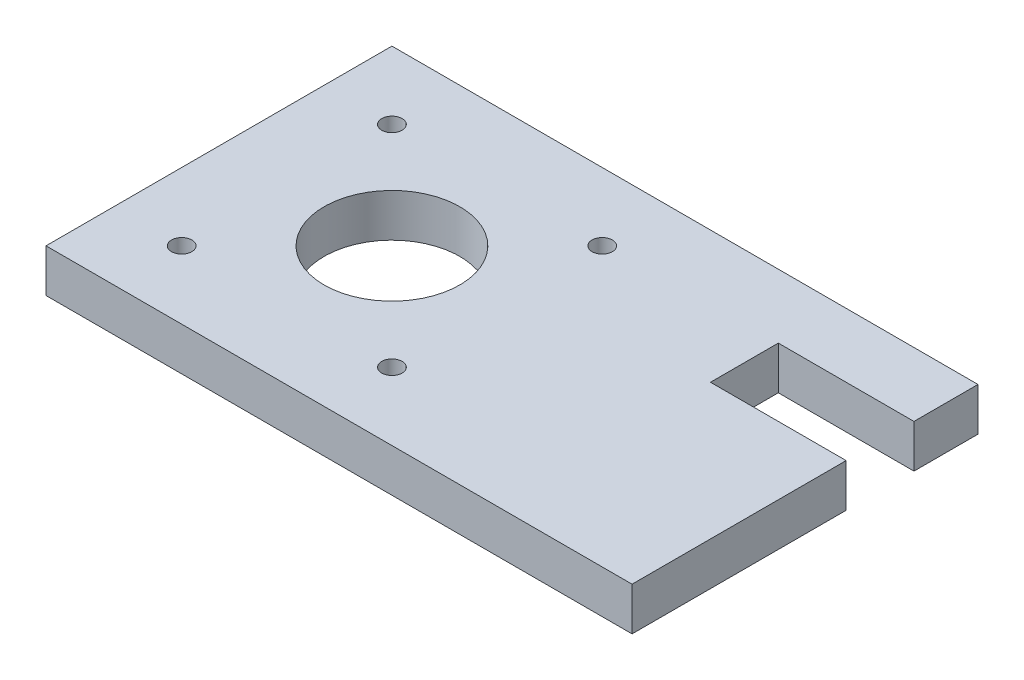
ISO-10303-21;
HEADER;
FILE_DESCRIPTION(('STEP AP214'),'2;1');
FILE_NAME('part.step','',(''),(''),'','','');
FILE_SCHEMA(('AUTOMOTIVE_DESIGN { 1 0 10303 214 1 1 1 1 }'));
ENDSEC;
DATA;
#1=APPLICATION_CONTEXT('core data for automotive mechanical design processes');
#2=APPLICATION_PROTOCOL_DEFINITION('international standard','automotive_design',2000,#1);
#3=PRODUCT_CONTEXT('',#1,'mechanical');
#4=PRODUCT('Part','Part','',(#3));
#5=PRODUCT_RELATED_PRODUCT_CATEGORY('part','',(#4));
#6=PRODUCT_DEFINITION_FORMATION('','',#4);
#7=PRODUCT_DEFINITION_CONTEXT('part definition',#1,'design');
#8=PRODUCT_DEFINITION('design','',#6,#7);
#9=PRODUCT_DEFINITION_SHAPE('','',#8);
#10=(LENGTH_UNIT() NAMED_UNIT(*) SI_UNIT(.MILLI.,.METRE.));
#11=(NAMED_UNIT(*) PLANE_ANGLE_UNIT() SI_UNIT($,.RADIAN.));
#12=(NAMED_UNIT(*) SI_UNIT($,.STERADIAN.) SOLID_ANGLE_UNIT());
#13=UNCERTAINTY_MEASURE_WITH_UNIT(LENGTH_MEASURE(1.E-05),#10,'distance_accuracy_value','');
#14=(GEOMETRIC_REPRESENTATION_CONTEXT(3) GLOBAL_UNCERTAINTY_ASSIGNED_CONTEXT((#13)) GLOBAL_UNIT_ASSIGNED_CONTEXT((#10,
#11,#12)) REPRESENTATION_CONTEXT('',''));
#15=CARTESIAN_POINT('',(0.,0.,0.));
#16=DIRECTION('',(0.,0.,1.));
#17=DIRECTION('',(1.,0.,0.));
#18=AXIS2_PLACEMENT_3D('',#15,#16,#17);
#19=CARTESIAN_POINT('',(0.,6.35,0.));
#20=DIRECTION('',(0.,-1.,0.));
#21=DIRECTION('',(0.,0.,-1.));
#22=AXIS2_PLACEMENT_3D('',#19,#20,#21);
#23=PLANE('',#22);
#24=DIRECTION('',(1.,0.,0.));
#25=VECTOR('',#24,1.);
#26=CARTESIAN_POINT('',(-25.5,6.35,25.5));
#27=LINE('',#26,#25);
#28=CARTESIAN_POINT('',(-25.5,6.35,25.5));
#29=VERTEX_POINT('',#28);
#30=CARTESIAN_POINT('',(60.9,6.35,25.5));
#31=VERTEX_POINT('',#30);
#32=EDGE_CURVE('E94',#29,#31,#27,.T.);
#33=ORIENTED_EDGE('',*,*,#32,.T.);
#34=DIRECTION('',(0.,0.,-1.));
#35=VECTOR('',#34,1.);
#36=CARTESIAN_POINT('',(60.9,6.35,-6.06183824368279));
#37=LINE('',#36,#35);
#38=CARTESIAN_POINT('',(60.9,6.35,-6.06183824368279));
#39=VERTEX_POINT('',#38);
#40=EDGE_CURVE('E179',#31,#39,#37,.T.);
#41=ORIENTED_EDGE('',*,*,#40,.T.);
#42=DIRECTION('',(-1.,0.,0.));
#43=VECTOR('',#42,1.);
#44=CARTESIAN_POINT('',(60.9,6.35,-6.06183824368279));
#45=LINE('',#44,#43);
#46=CARTESIAN_POINT('',(40.9,6.35,-6.06183824368279));
#47=VERTEX_POINT('',#46);
#48=EDGE_CURVE('E162',#39,#47,#45,.T.);
#49=ORIENTED_EDGE('',*,*,#48,.T.);
#50=DIRECTION('',(0.,0.,-1.));
#51=VECTOR('',#50,1.);
#52=CARTESIAN_POINT('',(40.9,6.35,-6.06183824368279));
#53=LINE('',#52,#51);
#54=CARTESIAN_POINT('',(40.9,6.35,-16.0618382436828));
#55=VERTEX_POINT('',#54);
#56=EDGE_CURVE('E175',#47,#55,#53,.T.);
#57=ORIENTED_EDGE('',*,*,#56,.T.);
#58=DIRECTION('',(1.,0.,0.));
#59=VECTOR('',#58,1.);
#60=CARTESIAN_POINT('',(60.9,6.35,-16.0618382436828));
#61=LINE('',#60,#59);
#62=CARTESIAN_POINT('',(60.9,6.35,-16.0618382436828));
#63=VERTEX_POINT('',#62);
#64=EDGE_CURVE('E114',#55,#63,#61,.T.);
#65=ORIENTED_EDGE('',*,*,#64,.T.);
#66=DIRECTION('',(0.,0.,-1.));
#67=VECTOR('',#66,1.);
#68=CARTESIAN_POINT('',(60.9,6.35,-25.5));
#69=LINE('',#68,#67);
#70=CARTESIAN_POINT('',(60.9,6.35,-25.5));
#71=VERTEX_POINT('',#70);
#72=EDGE_CURVE('E108',#63,#71,#69,.T.);
#73=ORIENTED_EDGE('',*,*,#72,.T.);
#74=DIRECTION('',(-1.,0.,0.));
#75=VECTOR('',#74,1.);
#76=CARTESIAN_POINT('',(60.9,6.35,-25.5));
#77=LINE('',#76,#75);
#78=CARTESIAN_POINT('',(-25.5,6.35,-25.5));
#79=VERTEX_POINT('',#78);
#80=EDGE_CURVE('E112',#71,#79,#77,.T.);
#81=ORIENTED_EDGE('',*,*,#80,.T.);
#82=DIRECTION('',(0.,0.,1.));
#83=VECTOR('',#82,1.);
#84=CARTESIAN_POINT('',(-25.5,6.35,-25.5));
#85=LINE('',#84,#83);
#86=EDGE_CURVE('E52',#79,#29,#85,.T.);
#87=ORIENTED_EDGE('',*,*,#86,.T.);
#88=EDGE_LOOP('',(#33,#41,#49,#57,#65,#73,#81,#87));
#89=FACE_BOUND('',#88,.T.);
#90=CARTESIAN_POINT('',(15.5,6.35,-15.5));
#91=DIRECTION('',(0.,1.,0.));
#92=DIRECTION('',(0.,0.,1.));
#93=AXIS2_PLACEMENT_3D('',#90,#91,#92);
#94=CIRCLE('',#93,1.5);
#95=CARTESIAN_POINT('',(15.5,6.35,-14.));
#96=VERTEX_POINT('',#95);
#97=EDGE_CURVE('E134',#96,#96,#94,.T.);
#98=ORIENTED_EDGE('',*,*,#97,.F.);
#99=EDGE_LOOP('',(#98));
#100=FACE_BOUND('',#99,.T.);
#101=CARTESIAN_POINT('',(15.5,6.35,15.5));
#102=DIRECTION('',(0.,1.,0.));
#103=DIRECTION('',(0.,0.,1.));
#104=AXIS2_PLACEMENT_3D('',#101,#102,#103);
#105=CIRCLE('',#104,1.5);
#106=CARTESIAN_POINT('',(15.5,6.35,17.));
#107=VERTEX_POINT('',#106);
#108=EDGE_CURVE('E185',#107,#107,#105,.T.);
#109=ORIENTED_EDGE('',*,*,#108,.F.);
#110=EDGE_LOOP('',(#109));
#111=FACE_BOUND('',#110,.T.);
#112=CARTESIAN_POINT('',(-15.5,6.35,15.5));
#113=DIRECTION('',(0.,1.,0.));
#114=DIRECTION('',(0.,0.,1.));
#115=AXIS2_PLACEMENT_3D('',#112,#113,#114);
#116=CIRCLE('',#115,1.5);
#117=CARTESIAN_POINT('',(-15.5,6.35,17.));
#118=VERTEX_POINT('',#117);
#119=EDGE_CURVE('E191',#118,#118,#116,.T.);
#120=ORIENTED_EDGE('',*,*,#119,.F.);
#121=EDGE_LOOP('',(#120));
#122=FACE_BOUND('',#121,.T.);
#123=CARTESIAN_POINT('',(-15.5,6.35,-15.5));
#124=DIRECTION('',(0.,1.,0.));
#125=DIRECTION('',(0.,0.,1.));
#126=AXIS2_PLACEMENT_3D('',#123,#124,#125);
#127=CIRCLE('',#126,1.5);
#128=CARTESIAN_POINT('',(-15.5,6.35,-14.));
#129=VERTEX_POINT('',#128);
#130=EDGE_CURVE('E197',#129,#129,#127,.T.);
#131=ORIENTED_EDGE('',*,*,#130,.F.);
#132=EDGE_LOOP('',(#131));
#133=FACE_BOUND('',#132,.T.);
#134=CARTESIAN_POINT('',(0.,6.35,0.));
#135=DIRECTION('',(0.,1.,0.));
#136=DIRECTION('',(0.,0.,1.));
#137=AXIS2_PLACEMENT_3D('',#134,#135,#136);
#138=CIRCLE('',#137,10.);
#139=CARTESIAN_POINT('',(0.,6.35,10.));
#140=VERTEX_POINT('',#139);
#141=EDGE_CURVE('E203',#140,#140,#138,.T.);
#142=ORIENTED_EDGE('',*,*,#141,.F.);
#143=EDGE_LOOP('',(#142));
#144=FACE_BOUND('',#143,.T.);
#145=ADVANCED_FACE('F35',(#89,#100,#111,#122,#133,#144),#23,.F.);
#146=CARTESIAN_POINT('',(0.,0.,0.));
#147=DIRECTION('',(0.,-1.,0.));
#148=DIRECTION('',(0.,0.,-1.));
#149=AXIS2_PLACEMENT_3D('',#146,#147,#148);
#150=PLANE('',#149);
#151=CARTESIAN_POINT('',(-15.5,0.,-15.5));
#152=DIRECTION('',(0.,1.,0.));
#153=DIRECTION('',(0.,0.,1.));
#154=AXIS2_PLACEMENT_3D('',#151,#152,#153);
#155=CIRCLE('',#154,1.5);
#156=CARTESIAN_POINT('',(-15.5,0.,-14.));
#157=VERTEX_POINT('',#156);
#158=EDGE_CURVE('E200',#157,#157,#155,.T.);
#159=ORIENTED_EDGE('',*,*,#158,.T.);
#160=EDGE_LOOP('',(#159));
#161=FACE_BOUND('',#160,.T.);
#162=CARTESIAN_POINT('',(15.5,0.,15.5));
#163=DIRECTION('',(0.,1.,0.));
#164=DIRECTION('',(0.,0.,1.));
#165=AXIS2_PLACEMENT_3D('',#162,#163,#164);
#166=CIRCLE('',#165,1.5);
#167=CARTESIAN_POINT('',(15.5,0.,17.));
#168=VERTEX_POINT('',#167);
#169=EDGE_CURVE('E188',#168,#168,#166,.T.);
#170=ORIENTED_EDGE('',*,*,#169,.T.);
#171=EDGE_LOOP('',(#170));
#172=FACE_BOUND('',#171,.T.);
#173=DIRECTION('',(1.,0.,0.));
#174=VECTOR('',#173,1.);
#175=CARTESIAN_POINT('',(60.9,0.,25.5));
#176=LINE('',#175,#174);
#177=CARTESIAN_POINT('',(-25.5,0.,25.5));
#178=VERTEX_POINT('',#177);
#179=CARTESIAN_POINT('',(60.9,0.,25.5));
#180=VERTEX_POINT('',#179);
#181=EDGE_CURVE('E88',#178,#180,#176,.T.);
#182=ORIENTED_EDGE('',*,*,#181,.F.);
#183=DIRECTION('',(0.,0.,1.));
#184=VECTOR('',#183,1.);
#185=CARTESIAN_POINT('',(-25.5,0.,-25.5));
#186=LINE('',#185,#184);
#187=CARTESIAN_POINT('',(-25.5,0.,-25.5));
#188=VERTEX_POINT('',#187);
#189=EDGE_CURVE('E144',#188,#178,#186,.T.);
#190=ORIENTED_EDGE('',*,*,#189,.F.);
#191=DIRECTION('',(-1.,0.,0.));
#192=VECTOR('',#191,1.);
#193=CARTESIAN_POINT('',(60.9,0.,-25.5));
#194=LINE('',#193,#192);
#195=CARTESIAN_POINT('',(60.9,0.,-25.5));
#196=VERTEX_POINT('',#195);
#197=EDGE_CURVE('E81',#196,#188,#194,.T.);
#198=ORIENTED_EDGE('',*,*,#197,.F.);
#199=DIRECTION('',(0.,0.,-1.));
#200=VECTOR('',#199,1.);
#201=CARTESIAN_POINT('',(60.9,0.,-25.5));
#202=LINE('',#201,#200);
#203=CARTESIAN_POINT('',(60.9,0.,-16.0618382436828));
#204=VERTEX_POINT('',#203);
#205=EDGE_CURVE('E122',#204,#196,#202,.T.);
#206=ORIENTED_EDGE('',*,*,#205,.F.);
#207=DIRECTION('',(1.,0.,0.));
#208=VECTOR('',#207,1.);
#209=CARTESIAN_POINT('',(60.9,0.,-16.0618382436828));
#210=LINE('',#209,#208);
#211=CARTESIAN_POINT('',(40.9,0.,-16.0618382436828));
#212=VERTEX_POINT('',#211);
#213=EDGE_CURVE('E140',#212,#204,#210,.T.);
#214=ORIENTED_EDGE('',*,*,#213,.F.);
#215=DIRECTION('',(0.,0.,-1.));
#216=VECTOR('',#215,1.);
#217=CARTESIAN_POINT('',(40.9,0.,-6.06183824368279));
#218=LINE('',#217,#216);
#219=CARTESIAN_POINT('',(40.9,0.,-6.06183824368279));
#220=VERTEX_POINT('',#219);
#221=EDGE_CURVE('E138',#220,#212,#218,.T.);
#222=ORIENTED_EDGE('',*,*,#221,.F.);
#223=DIRECTION('',(-1.,0.,0.));
#224=VECTOR('',#223,1.);
#225=CARTESIAN_POINT('',(60.9,0.,-6.06183824368279));
#226=LINE('',#225,#224);
#227=CARTESIAN_POINT('',(60.9,0.,-6.06183824368279));
#228=VERTEX_POINT('',#227);
#229=EDGE_CURVE('E136',#228,#220,#226,.T.);
#230=ORIENTED_EDGE('',*,*,#229,.F.);
#231=DIRECTION('',(0.,0.,-1.));
#232=VECTOR('',#231,1.);
#233=CARTESIAN_POINT('',(60.9,0.,-6.06183824368279));
#234=LINE('',#233,#232);
#235=EDGE_CURVE('E133',#180,#228,#234,.T.);
#236=ORIENTED_EDGE('',*,*,#235,.F.);
#237=EDGE_LOOP('',(#182,#190,#198,#206,#214,#222,#230,#236));
#238=FACE_BOUND('',#237,.T.);
#239=CARTESIAN_POINT('',(15.5,0.,-15.5));
#240=DIRECTION('',(0.,1.,0.));
#241=DIRECTION('',(0.,0.,1.));
#242=AXIS2_PLACEMENT_3D('',#239,#240,#241);
#243=CIRCLE('',#242,1.5);
#244=CARTESIAN_POINT('',(15.5,0.,-14.));
#245=VERTEX_POINT('',#244);
#246=EDGE_CURVE('E182',#245,#245,#243,.T.);
#247=ORIENTED_EDGE('',*,*,#246,.T.);
#248=EDGE_LOOP('',(#247));
#249=FACE_BOUND('',#248,.T.);
#250=CARTESIAN_POINT('',(-15.5,0.,15.5));
#251=DIRECTION('',(0.,1.,0.));
#252=DIRECTION('',(0.,0.,1.));
#253=AXIS2_PLACEMENT_3D('',#250,#251,#252);
#254=CIRCLE('',#253,1.5);
#255=CARTESIAN_POINT('',(-15.5,0.,17.));
#256=VERTEX_POINT('',#255);
#257=EDGE_CURVE('E194',#256,#256,#254,.T.);
#258=ORIENTED_EDGE('',*,*,#257,.T.);
#259=EDGE_LOOP('',(#258));
#260=FACE_BOUND('',#259,.T.);
#261=CARTESIAN_POINT('',(0.,0.,0.));
#262=DIRECTION('',(0.,1.,0.));
#263=DIRECTION('',(0.,0.,1.));
#264=AXIS2_PLACEMENT_3D('',#261,#262,#263);
#265=CIRCLE('',#264,10.);
#266=CARTESIAN_POINT('',(0.,0.,10.));
#267=VERTEX_POINT('',#266);
#268=EDGE_CURVE('E206',#267,#267,#265,.T.);
#269=ORIENTED_EDGE('',*,*,#268,.T.);
#270=EDGE_LOOP('',(#269));
#271=FACE_BOUND('',#270,.T.);
#272=ADVANCED_FACE('F166',(#161,#172,#238,#249,#260,#271),#150,.T.);
#273=CARTESIAN_POINT('',(60.9,6.35,25.5));
#274=DIRECTION('',(0.,0.,-1.));
#275=DIRECTION('',(-1.,0.,0.));
#276=AXIS2_PLACEMENT_3D('',#273,#274,#275);
#277=PLANE('',#276);
#278=ORIENTED_EDGE('',*,*,#181,.T.);
#279=DIRECTION('',(0.,-1.,0.));
#280=VECTOR('',#279,1.);
#281=CARTESIAN_POINT('',(60.9,6.35,25.5));
#282=LINE('',#281,#280);
#283=EDGE_CURVE('E11',#31,#180,#282,.T.);
#284=ORIENTED_EDGE('',*,*,#283,.F.);
#285=ORIENTED_EDGE('',*,*,#32,.F.);
#286=DIRECTION('',(0.,-1.,0.));
#287=VECTOR('',#286,1.);
#288=CARTESIAN_POINT('',(-25.5,6.35,25.5));
#289=LINE('',#288,#287);
#290=EDGE_CURVE('E128',#29,#178,#289,.T.);
#291=ORIENTED_EDGE('',*,*,#290,.T.);
#292=EDGE_LOOP('',(#278,#284,#285,#291));
#293=FACE_BOUND('',#292,.T.);
#294=ADVANCED_FACE('F37',(#293),#277,.F.);
#295=CARTESIAN_POINT('',(60.9,6.35,-6.06183824368279));
#296=DIRECTION('',(-1.,0.,0.));
#297=DIRECTION('',(0.,0.,1.));
#298=AXIS2_PLACEMENT_3D('',#295,#296,#297);
#299=PLANE('',#298);
#300=ORIENTED_EDGE('',*,*,#235,.T.);
#301=DIRECTION('',(0.,-1.,0.));
#302=VECTOR('',#301,1.);
#303=CARTESIAN_POINT('',(60.9,6.35,-6.06183824368279));
#304=LINE('',#303,#302);
#305=EDGE_CURVE('E44',#39,#228,#304,.T.);
#306=ORIENTED_EDGE('',*,*,#305,.F.);
#307=ORIENTED_EDGE('',*,*,#40,.F.);
#308=ORIENTED_EDGE('',*,*,#283,.T.);
#309=EDGE_LOOP('',(#300,#306,#307,#308));
#310=FACE_BOUND('',#309,.T.);
#311=ADVANCED_FACE('F239',(#310),#299,.F.);
#312=CARTESIAN_POINT('',(60.9,6.35,-6.06183824368279));
#313=DIRECTION('',(0.,0.,1.));
#314=DIRECTION('',(1.,0.,0.));
#315=AXIS2_PLACEMENT_3D('',#312,#313,#314);
#316=PLANE('',#315);
#317=ORIENTED_EDGE('',*,*,#229,.T.);
#318=DIRECTION('',(0.,-1.,0.));
#319=VECTOR('',#318,1.);
#320=CARTESIAN_POINT('',(40.9,6.35,-6.06183824368279));
#321=LINE('',#320,#319);
#322=EDGE_CURVE('E153',#47,#220,#321,.T.);
#323=ORIENTED_EDGE('',*,*,#322,.F.);
#324=ORIENTED_EDGE('',*,*,#48,.F.);
#325=ORIENTED_EDGE('',*,*,#305,.T.);
#326=EDGE_LOOP('',(#317,#323,#324,#325));
#327=FACE_BOUND('',#326,.T.);
#328=ADVANCED_FACE('F160',(#327),#316,.F.);
#329=CARTESIAN_POINT('',(40.9,6.35,-6.06183824368279));
#330=DIRECTION('',(-1.,0.,0.));
#331=DIRECTION('',(0.,0.,1.));
#332=AXIS2_PLACEMENT_3D('',#329,#330,#331);
#333=PLANE('',#332);
#334=ORIENTED_EDGE('',*,*,#221,.T.);
#335=DIRECTION('',(0.,-1.,0.));
#336=VECTOR('',#335,1.);
#337=CARTESIAN_POINT('',(40.9,6.35,-16.0618382436828));
#338=LINE('',#337,#336);
#339=EDGE_CURVE('E150',#55,#212,#338,.T.);
#340=ORIENTED_EDGE('',*,*,#339,.F.);
#341=ORIENTED_EDGE('',*,*,#56,.F.);
#342=ORIENTED_EDGE('',*,*,#322,.T.);
#343=EDGE_LOOP('',(#334,#340,#341,#342));
#344=FACE_BOUND('',#343,.T.);
#345=ADVANCED_FACE('F171',(#344),#333,.F.);
#346=CARTESIAN_POINT('',(60.9,6.35,-16.0618382436828));
#347=DIRECTION('',(0.,0.,-1.));
#348=DIRECTION('',(-1.,0.,0.));
#349=AXIS2_PLACEMENT_3D('',#346,#347,#348);
#350=PLANE('',#349);
#351=ORIENTED_EDGE('',*,*,#213,.T.);
#352=DIRECTION('',(0.,-1.,0.));
#353=VECTOR('',#352,1.);
#354=CARTESIAN_POINT('',(60.9,6.35,-16.0618382436828));
#355=LINE('',#354,#353);
#356=EDGE_CURVE('E123',#63,#204,#355,.T.);
#357=ORIENTED_EDGE('',*,*,#356,.F.);
#358=ORIENTED_EDGE('',*,*,#64,.F.);
#359=ORIENTED_EDGE('',*,*,#339,.T.);
#360=EDGE_LOOP('',(#351,#357,#358,#359));
#361=FACE_BOUND('',#360,.T.);
#362=ADVANCED_FACE('F174',(#361),#350,.F.);
#363=CARTESIAN_POINT('',(60.9,6.35,-25.5));
#364=DIRECTION('',(-1.,0.,0.));
#365=DIRECTION('',(0.,0.,1.));
#366=AXIS2_PLACEMENT_3D('',#363,#364,#365);
#367=PLANE('',#366);
#368=ORIENTED_EDGE('',*,*,#205,.T.);
#369=DIRECTION('',(0.,-1.,0.));
#370=VECTOR('',#369,1.);
#371=CARTESIAN_POINT('',(60.9,6.35,-25.5));
#372=LINE('',#371,#370);
#373=EDGE_CURVE('E119',#71,#196,#372,.T.);
#374=ORIENTED_EDGE('',*,*,#373,.F.);
#375=ORIENTED_EDGE('',*,*,#72,.F.);
#376=ORIENTED_EDGE('',*,*,#356,.T.);
#377=EDGE_LOOP('',(#368,#374,#375,#376));
#378=FACE_BOUND('',#377,.T.);
#379=ADVANCED_FACE('F120',(#378),#367,.F.);
#380=CARTESIAN_POINT('',(60.9,6.35,-25.5));
#381=DIRECTION('',(0.,0.,1.));
#382=DIRECTION('',(1.,0.,0.));
#383=AXIS2_PLACEMENT_3D('',#380,#381,#382);
#384=PLANE('',#383);
#385=ORIENTED_EDGE('',*,*,#197,.T.);
#386=DIRECTION('',(0.,-1.,0.));
#387=VECTOR('',#386,1.);
#388=CARTESIAN_POINT('',(-25.5,6.35,-25.5));
#389=LINE('',#388,#387);
#390=EDGE_CURVE('E124',#79,#188,#389,.T.);
#391=ORIENTED_EDGE('',*,*,#390,.F.);
#392=ORIENTED_EDGE('',*,*,#80,.F.);
#393=ORIENTED_EDGE('',*,*,#373,.T.);
#394=EDGE_LOOP('',(#385,#391,#392,#393));
#395=FACE_BOUND('',#394,.T.);
#396=ADVANCED_FACE('F126',(#395),#384,.F.);
#397=CARTESIAN_POINT('',(-25.5,6.35,-25.5));
#398=DIRECTION('',(1.,0.,0.));
#399=DIRECTION('',(0.,0.,-1.));
#400=AXIS2_PLACEMENT_3D('',#397,#398,#399);
#401=PLANE('',#400);
#402=ORIENTED_EDGE('',*,*,#189,.T.);
#403=ORIENTED_EDGE('',*,*,#290,.F.);
#404=ORIENTED_EDGE('',*,*,#86,.F.);
#405=ORIENTED_EDGE('',*,*,#390,.T.);
#406=EDGE_LOOP('',(#402,#403,#404,#405));
#407=FACE_BOUND('',#406,.T.);
#408=ADVANCED_FACE('F226',(#407),#401,.F.);
#409=CARTESIAN_POINT('',(15.5,6.35,-15.5));
#410=DIRECTION('',(0.,-1.,0.));
#411=DIRECTION('',(0.,0.,-1.));
#412=AXIS2_PLACEMENT_3D('',#409,#410,#411);
#413=CYLINDRICAL_SURFACE('',#412,1.5);
#414=ORIENTED_EDGE('',*,*,#97,.T.);
#415=EDGE_LOOP('',(#414));
#416=FACE_BOUND('',#415,.T.);
#417=ORIENTED_EDGE('',*,*,#246,.F.);
#418=EDGE_LOOP('',(#417));
#419=FACE_BOUND('',#418,.T.);
#420=ADVANCED_FACE('F223',(#416,#419),#413,.F.);
#421=CARTESIAN_POINT('',(15.5,6.35,15.5));
#422=DIRECTION('',(0.,-1.,0.));
#423=DIRECTION('',(0.,0.,-1.));
#424=AXIS2_PLACEMENT_3D('',#421,#422,#423);
#425=CYLINDRICAL_SURFACE('',#424,1.5);
#426=ORIENTED_EDGE('',*,*,#108,.T.);
#427=EDGE_LOOP('',(#426));
#428=FACE_BOUND('',#427,.T.);
#429=ORIENTED_EDGE('',*,*,#169,.F.);
#430=EDGE_LOOP('',(#429));
#431=FACE_BOUND('',#430,.T.);
#432=ADVANCED_FACE('F304',(#428,#431),#425,.F.);
#433=CARTESIAN_POINT('',(-15.5,6.35,15.5));
#434=DIRECTION('',(0.,-1.,0.));
#435=DIRECTION('',(0.,0.,-1.));
#436=AXIS2_PLACEMENT_3D('',#433,#434,#435);
#437=CYLINDRICAL_SURFACE('',#436,1.5);
#438=ORIENTED_EDGE('',*,*,#119,.T.);
#439=EDGE_LOOP('',(#438));
#440=FACE_BOUND('',#439,.T.);
#441=ORIENTED_EDGE('',*,*,#257,.F.);
#442=EDGE_LOOP('',(#441));
#443=FACE_BOUND('',#442,.T.);
#444=ADVANCED_FACE('F312',(#440,#443),#437,.F.);
#445=CARTESIAN_POINT('',(-15.5,6.35,-15.5));
#446=DIRECTION('',(0.,-1.,0.));
#447=DIRECTION('',(0.,0.,-1.));
#448=AXIS2_PLACEMENT_3D('',#445,#446,#447);
#449=CYLINDRICAL_SURFACE('',#448,1.5);
#450=ORIENTED_EDGE('',*,*,#130,.T.);
#451=EDGE_LOOP('',(#450));
#452=FACE_BOUND('',#451,.T.);
#453=ORIENTED_EDGE('',*,*,#158,.F.);
#454=EDGE_LOOP('',(#453));
#455=FACE_BOUND('',#454,.T.);
#456=ADVANCED_FACE('F320',(#452,#455),#449,.F.);
#457=CARTESIAN_POINT('',(0.,6.35,0.));
#458=DIRECTION('',(0.,-1.,0.));
#459=DIRECTION('',(0.,0.,-1.));
#460=AXIS2_PLACEMENT_3D('',#457,#458,#459);
#461=CYLINDRICAL_SURFACE('',#460,10.);
#462=ORIENTED_EDGE('',*,*,#141,.T.);
#463=EDGE_LOOP('',(#462));
#464=FACE_BOUND('',#463,.T.);
#465=ORIENTED_EDGE('',*,*,#268,.F.);
#466=EDGE_LOOP('',(#465));
#467=FACE_BOUND('',#466,.T.);
#468=ADVANCED_FACE('F212',(#464,#467),#461,.F.);
#469=CLOSED_SHELL('',(#145,#272,#294,#311,#328,#345,#362,#379,#396,#408,#420,#432,#444,#456,#468));
#470=MANIFOLD_SOLID_BREP('B2',#469);
#471=ADVANCED_BREP_SHAPE_REPRESENTATION('',(#18,#470),#14);
#472=SHAPE_DEFINITION_REPRESENTATION(#9,#471);
ENDSEC;
END-ISO-10303-21;
